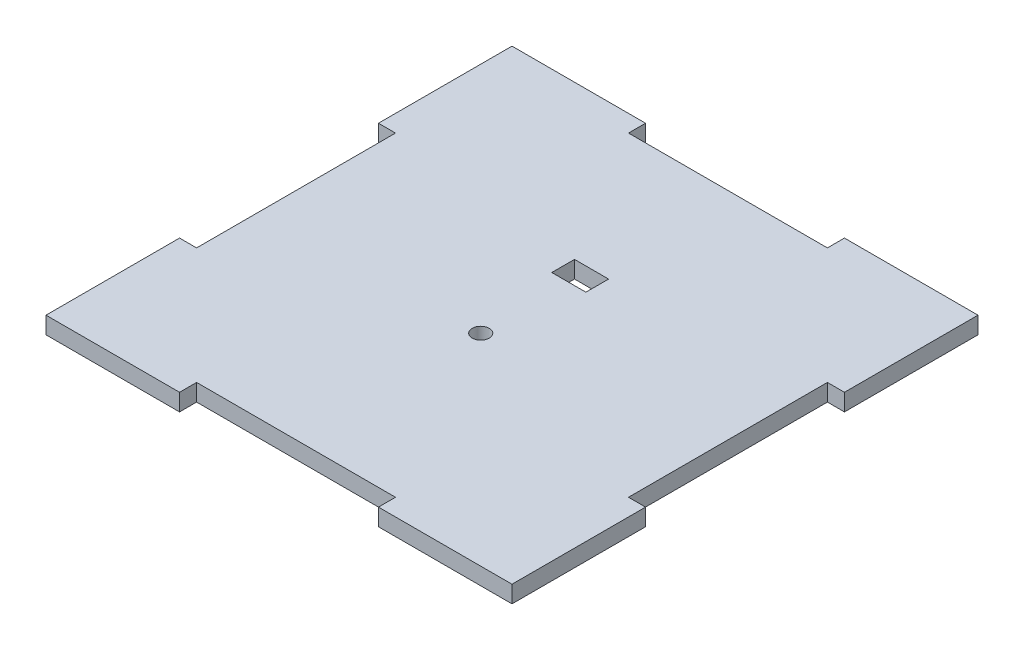
ISO-10303-21;
HEADER;
FILE_DESCRIPTION(('STEP AP214'),'2;1');
FILE_NAME('part.step','',(''),(''),'','','');
FILE_SCHEMA(('AUTOMOTIVE_DESIGN { 1 0 10303 214 1 1 1 1 }'));
ENDSEC;
DATA;
#1=APPLICATION_CONTEXT('core data for automotive mechanical design processes');
#2=APPLICATION_PROTOCOL_DEFINITION('international standard','automotive_design',2000,#1);
#3=PRODUCT_CONTEXT('',#1,'mechanical');
#4=PRODUCT('Part','Part','',(#3));
#5=PRODUCT_RELATED_PRODUCT_CATEGORY('part','',(#4));
#6=PRODUCT_DEFINITION_FORMATION('','',#4);
#7=PRODUCT_DEFINITION_CONTEXT('part definition',#1,'design');
#8=PRODUCT_DEFINITION('design','',#6,#7);
#9=PRODUCT_DEFINITION_SHAPE('','',#8);
#10=(LENGTH_UNIT() NAMED_UNIT(*) SI_UNIT(.MILLI.,.METRE.));
#11=(NAMED_UNIT(*) PLANE_ANGLE_UNIT() SI_UNIT($,.RADIAN.));
#12=(NAMED_UNIT(*) SI_UNIT($,.STERADIAN.) SOLID_ANGLE_UNIT());
#13=UNCERTAINTY_MEASURE_WITH_UNIT(LENGTH_MEASURE(1.E-05),#10,'distance_accuracy_value','');
#14=(GEOMETRIC_REPRESENTATION_CONTEXT(3) GLOBAL_UNCERTAINTY_ASSIGNED_CONTEXT((#13)) GLOBAL_UNIT_ASSIGNED_CONTEXT((#10,
#11,#12)) REPRESENTATION_CONTEXT('',''));
#15=CARTESIAN_POINT('',(0.,0.,0.));
#16=DIRECTION('',(0.,0.,1.));
#17=DIRECTION('',(1.,0.,0.));
#18=AXIS2_PLACEMENT_3D('',#15,#16,#17);
#19=CARTESIAN_POINT('',(41.,3.,-17.5));
#20=DIRECTION('',(-1.,0.,0.));
#21=DIRECTION('',(0.,0.,1.));
#22=AXIS2_PLACEMENT_3D('',#19,#20,#21);
#23=PLANE('',#22);
#24=DIRECTION('',(0.,0.,-1.));
#25=VECTOR('',#24,1.);
#26=CARTESIAN_POINT('',(41.,0.,-17.5));
#27=LINE('',#26,#25);
#28=CARTESIAN_POINT('',(41.,0.,-17.5));
#29=VERTEX_POINT('',#28);
#30=CARTESIAN_POINT('',(41.,0.,-41.));
#31=VERTEX_POINT('',#30);
#32=EDGE_CURVE('E243',#29,#31,#27,.T.);
#33=ORIENTED_EDGE('',*,*,#32,.T.);
#34=DIRECTION('',(0.,-1.,0.));
#35=VECTOR('',#34,1.);
#36=CARTESIAN_POINT('',(41.,3.,-41.));
#37=LINE('',#36,#35);
#38=CARTESIAN_POINT('',(41.,3.,-41.));
#39=VERTEX_POINT('',#38);
#40=EDGE_CURVE('E11',#39,#31,#37,.T.);
#41=ORIENTED_EDGE('',*,*,#40,.F.);
#42=DIRECTION('',(0.,0.,-1.));
#43=VECTOR('',#42,1.);
#44=CARTESIAN_POINT('',(41.,3.,-17.5));
#45=LINE('',#44,#43);
#46=CARTESIAN_POINT('',(41.,3.,-17.5));
#47=VERTEX_POINT('',#46);
#48=EDGE_CURVE('E256',#47,#39,#45,.T.);
#49=ORIENTED_EDGE('',*,*,#48,.F.);
#50=DIRECTION('',(0.,-1.,0.));
#51=VECTOR('',#50,1.);
#52=CARTESIAN_POINT('',(41.,3.,-17.5));
#53=LINE('',#52,#51);
#54=EDGE_CURVE('E318',#47,#29,#53,.T.);
#55=ORIENTED_EDGE('',*,*,#54,.T.);
#56=EDGE_LOOP('',(#33,#41,#49,#55));
#57=FACE_BOUND('',#56,.T.);
#58=ADVANCED_FACE('F38',(#57),#23,.F.);
#59=CARTESIAN_POINT('',(17.5,3.,-41.));
#60=DIRECTION('',(0.,0.,1.));
#61=DIRECTION('',(1.,0.,0.));
#62=AXIS2_PLACEMENT_3D('',#59,#60,#61);
#63=PLANE('',#62);
#64=DIRECTION('',(-1.,0.,0.));
#65=VECTOR('',#64,1.);
#66=CARTESIAN_POINT('',(17.5,0.,-41.));
#67=LINE('',#66,#65);
#68=CARTESIAN_POINT('',(17.5,0.,-41.));
#69=VERTEX_POINT('',#68);
#70=EDGE_CURVE('E322',#31,#69,#67,.T.);
#71=ORIENTED_EDGE('',*,*,#70,.T.);
#72=DIRECTION('',(0.,-1.,0.));
#73=VECTOR('',#72,1.);
#74=CARTESIAN_POINT('',(17.5,3.,-41.));
#75=LINE('',#74,#73);
#76=CARTESIAN_POINT('',(17.5,3.,-41.));
#77=VERTEX_POINT('',#76);
#78=EDGE_CURVE('E46',#77,#69,#75,.T.);
#79=ORIENTED_EDGE('',*,*,#78,.F.);
#80=DIRECTION('',(-1.,0.,0.));
#81=VECTOR('',#80,1.);
#82=CARTESIAN_POINT('',(17.5,3.,-41.));
#83=LINE('',#82,#81);
#84=EDGE_CURVE('E260',#39,#77,#83,.T.);
#85=ORIENTED_EDGE('',*,*,#84,.F.);
#86=ORIENTED_EDGE('',*,*,#40,.T.);
#87=EDGE_LOOP('',(#71,#79,#85,#86));
#88=FACE_BOUND('',#87,.T.);
#89=ADVANCED_FACE('F476',(#88),#63,.F.);
#90=CARTESIAN_POINT('',(17.5,3.,-38.));
#91=DIRECTION('',(1.,0.,0.));
#92=DIRECTION('',(0.,0.,-1.));
#93=AXIS2_PLACEMENT_3D('',#90,#91,#92);
#94=PLANE('',#93);
#95=DIRECTION('',(0.,0.,1.));
#96=VECTOR('',#95,1.);
#97=CARTESIAN_POINT('',(17.5,0.,-38.));
#98=LINE('',#97,#96);
#99=CARTESIAN_POINT('',(17.5,0.,-38.));
#100=VERTEX_POINT('',#99);
#101=EDGE_CURVE('E325',#69,#100,#98,.T.);
#102=ORIENTED_EDGE('',*,*,#101,.T.);
#103=DIRECTION('',(0.,-1.,0.));
#104=VECTOR('',#103,1.);
#105=CARTESIAN_POINT('',(17.5,3.,-38.));
#106=LINE('',#105,#104);
#107=CARTESIAN_POINT('',(17.5,3.,-38.));
#108=VERTEX_POINT('',#107);
#109=EDGE_CURVE('E445',#108,#100,#106,.T.);
#110=ORIENTED_EDGE('',*,*,#109,.F.);
#111=DIRECTION('',(0.,0.,1.));
#112=VECTOR('',#111,1.);
#113=CARTESIAN_POINT('',(17.5,3.,-38.));
#114=LINE('',#113,#112);
#115=EDGE_CURVE('E264',#77,#108,#114,.T.);
#116=ORIENTED_EDGE('',*,*,#115,.F.);
#117=ORIENTED_EDGE('',*,*,#78,.T.);
#118=EDGE_LOOP('',(#102,#110,#116,#117));
#119=FACE_BOUND('',#118,.T.);
#120=ADVANCED_FACE('F454',(#119),#94,.F.);
#121=CARTESIAN_POINT('',(-17.5,3.,-38.));
#122=DIRECTION('',(0.,0.,1.));
#123=DIRECTION('',(1.,0.,0.));
#124=AXIS2_PLACEMENT_3D('',#121,#122,#123);
#125=PLANE('',#124);
#126=DIRECTION('',(-1.,0.,0.));
#127=VECTOR('',#126,1.);
#128=CARTESIAN_POINT('',(-17.5,0.,-38.));
#129=LINE('',#128,#127);
#130=CARTESIAN_POINT('',(-17.5,0.,-38.));
#131=VERTEX_POINT('',#130);
#132=EDGE_CURVE('E328',#100,#131,#129,.T.);
#133=ORIENTED_EDGE('',*,*,#132,.T.);
#134=DIRECTION('',(0.,-1.,0.));
#135=VECTOR('',#134,1.);
#136=CARTESIAN_POINT('',(-17.5,3.,-38.));
#137=LINE('',#136,#135);
#138=CARTESIAN_POINT('',(-17.5,3.,-38.));
#139=VERTEX_POINT('',#138);
#140=EDGE_CURVE('E441',#139,#131,#137,.T.);
#141=ORIENTED_EDGE('',*,*,#140,.F.);
#142=DIRECTION('',(-1.,0.,0.));
#143=VECTOR('',#142,1.);
#144=CARTESIAN_POINT('',(-17.5,3.,-38.));
#145=LINE('',#144,#143);
#146=EDGE_CURVE('E267',#108,#139,#145,.T.);
#147=ORIENTED_EDGE('',*,*,#146,.F.);
#148=ORIENTED_EDGE('',*,*,#109,.T.);
#149=EDGE_LOOP('',(#133,#141,#147,#148));
#150=FACE_BOUND('',#149,.T.);
#151=ADVANCED_FACE('F464',(#150),#125,.F.);
#152=CARTESIAN_POINT('',(-17.5,3.,-41.));
#153=DIRECTION('',(-1.,0.,0.));
#154=DIRECTION('',(0.,0.,1.));
#155=AXIS2_PLACEMENT_3D('',#152,#153,#154);
#156=PLANE('',#155);
#157=DIRECTION('',(0.,0.,-1.));
#158=VECTOR('',#157,1.);
#159=CARTESIAN_POINT('',(-17.5,0.,-41.));
#160=LINE('',#159,#158);
#161=CARTESIAN_POINT('',(-17.5,0.,-41.));
#162=VERTEX_POINT('',#161);
#163=EDGE_CURVE('E331',#131,#162,#160,.T.);
#164=ORIENTED_EDGE('',*,*,#163,.T.);
#165=DIRECTION('',(0.,-1.,0.));
#166=VECTOR('',#165,1.);
#167=CARTESIAN_POINT('',(-17.5,3.,-41.));
#168=LINE('',#167,#166);
#169=CARTESIAN_POINT('',(-17.5,3.,-41.));
#170=VERTEX_POINT('',#169);
#171=EDGE_CURVE('E437',#170,#162,#168,.T.);
#172=ORIENTED_EDGE('',*,*,#171,.F.);
#173=DIRECTION('',(0.,0.,-1.));
#174=VECTOR('',#173,1.);
#175=CARTESIAN_POINT('',(-17.5,3.,-41.));
#176=LINE('',#175,#174);
#177=EDGE_CURVE('E270',#139,#170,#176,.T.);
#178=ORIENTED_EDGE('',*,*,#177,.F.);
#179=ORIENTED_EDGE('',*,*,#140,.T.);
#180=EDGE_LOOP('',(#164,#172,#178,#179));
#181=FACE_BOUND('',#180,.T.);
#182=ADVANCED_FACE('F468',(#181),#156,.F.);
#183=CARTESIAN_POINT('',(-41.,3.,-41.));
#184=DIRECTION('',(0.,0.,1.));
#185=DIRECTION('',(1.,0.,0.));
#186=AXIS2_PLACEMENT_3D('',#183,#184,#185);
#187=PLANE('',#186);
#188=DIRECTION('',(-1.,0.,0.));
#189=VECTOR('',#188,1.);
#190=CARTESIAN_POINT('',(-41.,0.,-41.));
#191=LINE('',#190,#189);
#192=CARTESIAN_POINT('',(-41.,0.,-41.));
#193=VERTEX_POINT('',#192);
#194=EDGE_CURVE('E334',#162,#193,#191,.T.);
#195=ORIENTED_EDGE('',*,*,#194,.T.);
#196=DIRECTION('',(0.,-1.,0.));
#197=VECTOR('',#196,1.);
#198=CARTESIAN_POINT('',(-41.,3.,-41.));
#199=LINE('',#198,#197);
#200=CARTESIAN_POINT('',(-41.,3.,-41.));
#201=VERTEX_POINT('',#200);
#202=EDGE_CURVE('E433',#201,#193,#199,.T.);
#203=ORIENTED_EDGE('',*,*,#202,.F.);
#204=DIRECTION('',(-1.,0.,0.));
#205=VECTOR('',#204,1.);
#206=CARTESIAN_POINT('',(-41.,3.,-41.));
#207=LINE('',#206,#205);
#208=EDGE_CURVE('E273',#170,#201,#207,.T.);
#209=ORIENTED_EDGE('',*,*,#208,.F.);
#210=ORIENTED_EDGE('',*,*,#171,.T.);
#211=EDGE_LOOP('',(#195,#203,#209,#210));
#212=FACE_BOUND('',#211,.T.);
#213=ADVANCED_FACE('F549',(#212),#187,.F.);
#214=CARTESIAN_POINT('',(-41.,3.,-17.5));
#215=DIRECTION('',(1.,0.,0.));
#216=DIRECTION('',(0.,0.,-1.));
#217=AXIS2_PLACEMENT_3D('',#214,#215,#216);
#218=PLANE('',#217);
#219=DIRECTION('',(0.,0.,1.));
#220=VECTOR('',#219,1.);
#221=CARTESIAN_POINT('',(-41.,0.,-17.5));
#222=LINE('',#221,#220);
#223=CARTESIAN_POINT('',(-41.,0.,-17.5));
#224=VERTEX_POINT('',#223);
#225=EDGE_CURVE('E337',#193,#224,#222,.T.);
#226=ORIENTED_EDGE('',*,*,#225,.T.);
#227=DIRECTION('',(0.,-1.,0.));
#228=VECTOR('',#227,1.);
#229=CARTESIAN_POINT('',(-41.,3.,-17.5));
#230=LINE('',#229,#228);
#231=CARTESIAN_POINT('',(-41.,3.,-17.5));
#232=VERTEX_POINT('',#231);
#233=EDGE_CURVE('E429',#232,#224,#230,.T.);
#234=ORIENTED_EDGE('',*,*,#233,.F.);
#235=DIRECTION('',(0.,0.,1.));
#236=VECTOR('',#235,1.);
#237=CARTESIAN_POINT('',(-41.,3.,-17.5));
#238=LINE('',#237,#236);
#239=EDGE_CURVE('E276',#201,#232,#238,.T.);
#240=ORIENTED_EDGE('',*,*,#239,.F.);
#241=ORIENTED_EDGE('',*,*,#202,.T.);
#242=EDGE_LOOP('',(#226,#234,#240,#241));
#243=FACE_BOUND('',#242,.T.);
#244=ADVANCED_FACE('F547',(#243),#218,.F.);
#245=CARTESIAN_POINT('',(-41.,3.,-17.5));
#246=DIRECTION('',(0.,0.,-1.));
#247=DIRECTION('',(-1.,0.,0.));
#248=AXIS2_PLACEMENT_3D('',#245,#246,#247);
#249=PLANE('',#248);
#250=DIRECTION('',(1.,0.,0.));
#251=VECTOR('',#250,1.);
#252=CARTESIAN_POINT('',(-41.,0.,-17.5));
#253=LINE('',#252,#251);
#254=CARTESIAN_POINT('',(-38.,0.,-17.5));
#255=VERTEX_POINT('',#254);
#256=EDGE_CURVE('E340',#224,#255,#253,.T.);
#257=ORIENTED_EDGE('',*,*,#256,.T.);
#258=DIRECTION('',(0.,-1.,0.));
#259=VECTOR('',#258,1.);
#260=CARTESIAN_POINT('',(-38.,3.,-17.5));
#261=LINE('',#260,#259);
#262=CARTESIAN_POINT('',(-38.,3.,-17.5));
#263=VERTEX_POINT('',#262);
#264=EDGE_CURVE('E425',#263,#255,#261,.T.);
#265=ORIENTED_EDGE('',*,*,#264,.F.);
#266=DIRECTION('',(1.,0.,0.));
#267=VECTOR('',#266,1.);
#268=CARTESIAN_POINT('',(-41.,3.,-17.5));
#269=LINE('',#268,#267);
#270=EDGE_CURVE('E279',#232,#263,#269,.T.);
#271=ORIENTED_EDGE('',*,*,#270,.F.);
#272=ORIENTED_EDGE('',*,*,#233,.T.);
#273=EDGE_LOOP('',(#257,#265,#271,#272));
#274=FACE_BOUND('',#273,.T.);
#275=ADVANCED_FACE('F542',(#274),#249,.F.);
#276=CARTESIAN_POINT('',(-38.,3.,-17.5));
#277=DIRECTION('',(1.,0.,0.));
#278=DIRECTION('',(0.,0.,-1.));
#279=AXIS2_PLACEMENT_3D('',#276,#277,#278);
#280=PLANE('',#279);
#281=DIRECTION('',(0.,0.,1.));
#282=VECTOR('',#281,1.);
#283=CARTESIAN_POINT('',(-38.,0.,-17.5));
#284=LINE('',#283,#282);
#285=CARTESIAN_POINT('',(-38.,0.,17.5));
#286=VERTEX_POINT('',#285);
#287=EDGE_CURVE('E343',#255,#286,#284,.T.);
#288=ORIENTED_EDGE('',*,*,#287,.T.);
#289=DIRECTION('',(0.,-1.,0.));
#290=VECTOR('',#289,1.);
#291=CARTESIAN_POINT('',(-38.,3.,17.5));
#292=LINE('',#291,#290);
#293=CARTESIAN_POINT('',(-38.,3.,17.5));
#294=VERTEX_POINT('',#293);
#295=EDGE_CURVE('E421',#294,#286,#292,.T.);
#296=ORIENTED_EDGE('',*,*,#295,.F.);
#297=DIRECTION('',(0.,0.,1.));
#298=VECTOR('',#297,1.);
#299=CARTESIAN_POINT('',(-38.,3.,-17.5));
#300=LINE('',#299,#298);
#301=EDGE_CURVE('E282',#263,#294,#300,.T.);
#302=ORIENTED_EDGE('',*,*,#301,.F.);
#303=ORIENTED_EDGE('',*,*,#264,.T.);
#304=EDGE_LOOP('',(#288,#296,#302,#303));
#305=FACE_BOUND('',#304,.T.);
#306=ADVANCED_FACE('F537',(#305),#280,.F.);
#307=CARTESIAN_POINT('',(-38.,3.,17.5));
#308=DIRECTION('',(0.,0.,1.));
#309=DIRECTION('',(1.,0.,0.));
#310=AXIS2_PLACEMENT_3D('',#307,#308,#309);
#311=PLANE('',#310);
#312=DIRECTION('',(-1.,0.,0.));
#313=VECTOR('',#312,1.);
#314=CARTESIAN_POINT('',(-38.,0.,17.5));
#315=LINE('',#314,#313);
#316=CARTESIAN_POINT('',(-41.,0.,17.5));
#317=VERTEX_POINT('',#316);
#318=EDGE_CURVE('E346',#286,#317,#315,.T.);
#319=ORIENTED_EDGE('',*,*,#318,.T.);
#320=DIRECTION('',(0.,-1.,0.));
#321=VECTOR('',#320,1.);
#322=CARTESIAN_POINT('',(-41.,3.,17.5));
#323=LINE('',#322,#321);
#324=CARTESIAN_POINT('',(-41.,3.,17.5));
#325=VERTEX_POINT('',#324);
#326=EDGE_CURVE('E417',#325,#317,#323,.T.);
#327=ORIENTED_EDGE('',*,*,#326,.F.);
#328=DIRECTION('',(-1.,0.,0.));
#329=VECTOR('',#328,1.);
#330=CARTESIAN_POINT('',(-38.,3.,17.5));
#331=LINE('',#330,#329);
#332=EDGE_CURVE('E285',#294,#325,#331,.T.);
#333=ORIENTED_EDGE('',*,*,#332,.F.);
#334=ORIENTED_EDGE('',*,*,#295,.T.);
#335=EDGE_LOOP('',(#319,#327,#333,#334));
#336=FACE_BOUND('',#335,.T.);
#337=ADVANCED_FACE('F533',(#336),#311,.F.);
#338=CARTESIAN_POINT('',(-41.,3.,41.));
#339=DIRECTION('',(1.,0.,0.));
#340=DIRECTION('',(0.,0.,-1.));
#341=AXIS2_PLACEMENT_3D('',#338,#339,#340);
#342=PLANE('',#341);
#343=DIRECTION('',(0.,0.,1.));
#344=VECTOR('',#343,1.);
#345=CARTESIAN_POINT('',(-41.,0.,41.));
#346=LINE('',#345,#344);
#347=CARTESIAN_POINT('',(-41.,0.,41.));
#348=VERTEX_POINT('',#347);
#349=EDGE_CURVE('E349',#317,#348,#346,.T.);
#350=ORIENTED_EDGE('',*,*,#349,.T.);
#351=DIRECTION('',(0.,-1.,0.));
#352=VECTOR('',#351,1.);
#353=CARTESIAN_POINT('',(-41.,3.,41.));
#354=LINE('',#353,#352);
#355=CARTESIAN_POINT('',(-41.,3.,41.));
#356=VERTEX_POINT('',#355);
#357=EDGE_CURVE('E413',#356,#348,#354,.T.);
#358=ORIENTED_EDGE('',*,*,#357,.F.);
#359=DIRECTION('',(0.,0.,1.));
#360=VECTOR('',#359,1.);
#361=CARTESIAN_POINT('',(-41.,3.,41.));
#362=LINE('',#361,#360);
#363=EDGE_CURVE('E288',#325,#356,#362,.T.);
#364=ORIENTED_EDGE('',*,*,#363,.F.);
#365=ORIENTED_EDGE('',*,*,#326,.T.);
#366=EDGE_LOOP('',(#350,#358,#364,#365));
#367=FACE_BOUND('',#366,.T.);
#368=ADVANCED_FACE('F528',(#367),#342,.F.);
#369=CARTESIAN_POINT('',(-41.,3.,41.));
#370=DIRECTION('',(0.,0.,-1.));
#371=DIRECTION('',(-1.,0.,0.));
#372=AXIS2_PLACEMENT_3D('',#369,#370,#371);
#373=PLANE('',#372);
#374=DIRECTION('',(1.,0.,0.));
#375=VECTOR('',#374,1.);
#376=CARTESIAN_POINT('',(-41.,0.,41.));
#377=LINE('',#376,#375);
#378=CARTESIAN_POINT('',(-17.5,0.,41.));
#379=VERTEX_POINT('',#378);
#380=EDGE_CURVE('E352',#348,#379,#377,.T.);
#381=ORIENTED_EDGE('',*,*,#380,.T.);
#382=DIRECTION('',(0.,-1.,0.));
#383=VECTOR('',#382,1.);
#384=CARTESIAN_POINT('',(-17.5,3.,41.));
#385=LINE('',#384,#383);
#386=CARTESIAN_POINT('',(-17.5,3.,41.));
#387=VERTEX_POINT('',#386);
#388=EDGE_CURVE('E409',#387,#379,#385,.T.);
#389=ORIENTED_EDGE('',*,*,#388,.F.);
#390=DIRECTION('',(1.,0.,0.));
#391=VECTOR('',#390,1.);
#392=CARTESIAN_POINT('',(-41.,3.,41.));
#393=LINE('',#392,#391);
#394=EDGE_CURVE('E291',#356,#387,#393,.T.);
#395=ORIENTED_EDGE('',*,*,#394,.F.);
#396=ORIENTED_EDGE('',*,*,#357,.T.);
#397=EDGE_LOOP('',(#381,#389,#395,#396));
#398=FACE_BOUND('',#397,.T.);
#399=ADVANCED_FACE('F522',(#398),#373,.F.);
#400=CARTESIAN_POINT('',(-17.5,3.,38.));
#401=DIRECTION('',(-1.,0.,0.));
#402=DIRECTION('',(0.,0.,1.));
#403=AXIS2_PLACEMENT_3D('',#400,#401,#402);
#404=PLANE('',#403);
#405=DIRECTION('',(0.,0.,-1.));
#406=VECTOR('',#405,1.);
#407=CARTESIAN_POINT('',(-17.5,0.,38.));
#408=LINE('',#407,#406);
#409=CARTESIAN_POINT('',(-17.5,0.,38.));
#410=VERTEX_POINT('',#409);
#411=EDGE_CURVE('E355',#379,#410,#408,.T.);
#412=ORIENTED_EDGE('',*,*,#411,.T.);
#413=DIRECTION('',(0.,-1.,0.));
#414=VECTOR('',#413,1.);
#415=CARTESIAN_POINT('',(-17.5,3.,38.));
#416=LINE('',#415,#414);
#417=CARTESIAN_POINT('',(-17.5,3.,38.));
#418=VERTEX_POINT('',#417);
#419=EDGE_CURVE('E405',#418,#410,#416,.T.);
#420=ORIENTED_EDGE('',*,*,#419,.F.);
#421=DIRECTION('',(0.,0.,-1.));
#422=VECTOR('',#421,1.);
#423=CARTESIAN_POINT('',(-17.5,3.,38.));
#424=LINE('',#423,#422);
#425=EDGE_CURVE('E294',#387,#418,#424,.T.);
#426=ORIENTED_EDGE('',*,*,#425,.F.);
#427=ORIENTED_EDGE('',*,*,#388,.T.);
#428=EDGE_LOOP('',(#412,#420,#426,#427));
#429=FACE_BOUND('',#428,.T.);
#430=ADVANCED_FACE('F518',(#429),#404,.F.);
#431=CARTESIAN_POINT('',(17.5,3.,38.));
#432=DIRECTION('',(0.,0.,-1.));
#433=DIRECTION('',(-1.,0.,0.));
#434=AXIS2_PLACEMENT_3D('',#431,#432,#433);
#435=PLANE('',#434);
#436=DIRECTION('',(1.,0.,0.));
#437=VECTOR('',#436,1.);
#438=CARTESIAN_POINT('',(17.5,0.,38.));
#439=LINE('',#438,#437);
#440=CARTESIAN_POINT('',(17.5,0.,38.));
#441=VERTEX_POINT('',#440);
#442=EDGE_CURVE('E358',#410,#441,#439,.T.);
#443=ORIENTED_EDGE('',*,*,#442,.T.);
#444=DIRECTION('',(0.,-1.,0.));
#445=VECTOR('',#444,1.);
#446=CARTESIAN_POINT('',(17.5,3.,38.));
#447=LINE('',#446,#445);
#448=CARTESIAN_POINT('',(17.5,3.,38.));
#449=VERTEX_POINT('',#448);
#450=EDGE_CURVE('E401',#449,#441,#447,.T.);
#451=ORIENTED_EDGE('',*,*,#450,.F.);
#452=DIRECTION('',(1.,0.,0.));
#453=VECTOR('',#452,1.);
#454=CARTESIAN_POINT('',(17.5,3.,38.));
#455=LINE('',#454,#453);
#456=EDGE_CURVE('E297',#418,#449,#455,.T.);
#457=ORIENTED_EDGE('',*,*,#456,.F.);
#458=ORIENTED_EDGE('',*,*,#419,.T.);
#459=EDGE_LOOP('',(#443,#451,#457,#458));
#460=FACE_BOUND('',#459,.T.);
#461=ADVANCED_FACE('F513',(#460),#435,.F.);
#462=CARTESIAN_POINT('',(17.5,3.,41.));
#463=DIRECTION('',(1.,0.,0.));
#464=DIRECTION('',(0.,0.,-1.));
#465=AXIS2_PLACEMENT_3D('',#462,#463,#464);
#466=PLANE('',#465);
#467=DIRECTION('',(0.,0.,1.));
#468=VECTOR('',#467,1.);
#469=CARTESIAN_POINT('',(17.5,0.,41.));
#470=LINE('',#469,#468);
#471=CARTESIAN_POINT('',(17.5,0.,41.));
#472=VERTEX_POINT('',#471);
#473=EDGE_CURVE('E361',#441,#472,#470,.T.);
#474=ORIENTED_EDGE('',*,*,#473,.T.);
#475=DIRECTION('',(0.,-1.,0.));
#476=VECTOR('',#475,1.);
#477=CARTESIAN_POINT('',(17.5,3.,41.));
#478=LINE('',#477,#476);
#479=CARTESIAN_POINT('',(17.5,3.,41.));
#480=VERTEX_POINT('',#479);
#481=EDGE_CURVE('E397',#480,#472,#478,.T.);
#482=ORIENTED_EDGE('',*,*,#481,.F.);
#483=DIRECTION('',(0.,0.,1.));
#484=VECTOR('',#483,1.);
#485=CARTESIAN_POINT('',(17.5,3.,41.));
#486=LINE('',#485,#484);
#487=EDGE_CURVE('E300',#449,#480,#486,.T.);
#488=ORIENTED_EDGE('',*,*,#487,.F.);
#489=ORIENTED_EDGE('',*,*,#450,.T.);
#490=EDGE_LOOP('',(#474,#482,#488,#489));
#491=FACE_BOUND('',#490,.T.);
#492=ADVANCED_FACE('F507',(#491),#466,.F.);
#493=CARTESIAN_POINT('',(17.5,3.,41.));
#494=DIRECTION('',(0.,0.,-1.));
#495=DIRECTION('',(-1.,0.,0.));
#496=AXIS2_PLACEMENT_3D('',#493,#494,#495);
#497=PLANE('',#496);
#498=DIRECTION('',(1.,0.,0.));
#499=VECTOR('',#498,1.);
#500=CARTESIAN_POINT('',(17.5,0.,41.));
#501=LINE('',#500,#499);
#502=CARTESIAN_POINT('',(41.,0.,41.));
#503=VERTEX_POINT('',#502);
#504=EDGE_CURVE('E364',#472,#503,#501,.T.);
#505=ORIENTED_EDGE('',*,*,#504,.T.);
#506=DIRECTION('',(0.,-1.,0.));
#507=VECTOR('',#506,1.);
#508=CARTESIAN_POINT('',(41.,3.,41.));
#509=LINE('',#508,#507);
#510=CARTESIAN_POINT('',(41.,3.,41.));
#511=VERTEX_POINT('',#510);
#512=EDGE_CURVE('E393',#511,#503,#509,.T.);
#513=ORIENTED_EDGE('',*,*,#512,.F.);
#514=DIRECTION('',(1.,0.,0.));
#515=VECTOR('',#514,1.);
#516=CARTESIAN_POINT('',(17.5,3.,41.));
#517=LINE('',#516,#515);
#518=EDGE_CURVE('E303',#480,#511,#517,.T.);
#519=ORIENTED_EDGE('',*,*,#518,.F.);
#520=ORIENTED_EDGE('',*,*,#481,.T.);
#521=EDGE_LOOP('',(#505,#513,#519,#520));
#522=FACE_BOUND('',#521,.T.);
#523=ADVANCED_FACE('F503',(#522),#497,.F.);
#524=CARTESIAN_POINT('',(41.,3.,41.));
#525=DIRECTION('',(-1.,0.,0.));
#526=DIRECTION('',(0.,0.,1.));
#527=AXIS2_PLACEMENT_3D('',#524,#525,#526);
#528=PLANE('',#527);
#529=DIRECTION('',(0.,0.,-1.));
#530=VECTOR('',#529,1.);
#531=CARTESIAN_POINT('',(41.,0.,41.));
#532=LINE('',#531,#530);
#533=CARTESIAN_POINT('',(41.,0.,17.5));
#534=VERTEX_POINT('',#533);
#535=EDGE_CURVE('E367',#503,#534,#532,.T.);
#536=ORIENTED_EDGE('',*,*,#535,.T.);
#537=DIRECTION('',(0.,-1.,0.));
#538=VECTOR('',#537,1.);
#539=CARTESIAN_POINT('',(41.,3.,17.5));
#540=LINE('',#539,#538);
#541=CARTESIAN_POINT('',(41.,3.,17.5));
#542=VERTEX_POINT('',#541);
#543=EDGE_CURVE('E389',#542,#534,#540,.T.);
#544=ORIENTED_EDGE('',*,*,#543,.F.);
#545=DIRECTION('',(0.,0.,-1.));
#546=VECTOR('',#545,1.);
#547=CARTESIAN_POINT('',(41.,3.,41.));
#548=LINE('',#547,#546);
#549=EDGE_CURVE('E306',#511,#542,#548,.T.);
#550=ORIENTED_EDGE('',*,*,#549,.F.);
#551=ORIENTED_EDGE('',*,*,#512,.T.);
#552=EDGE_LOOP('',(#536,#544,#550,#551));
#553=FACE_BOUND('',#552,.T.);
#554=ADVANCED_FACE('F498',(#553),#528,.F.);
#555=CARTESIAN_POINT('',(38.,3.,17.5));
#556=DIRECTION('',(0.,0.,1.));
#557=DIRECTION('',(1.,0.,0.));
#558=AXIS2_PLACEMENT_3D('',#555,#556,#557);
#559=PLANE('',#558);
#560=DIRECTION('',(-1.,0.,0.));
#561=VECTOR('',#560,1.);
#562=CARTESIAN_POINT('',(38.,0.,17.5));
#563=LINE('',#562,#561);
#564=CARTESIAN_POINT('',(38.,0.,17.5));
#565=VERTEX_POINT('',#564);
#566=EDGE_CURVE('E370',#534,#565,#563,.T.);
#567=ORIENTED_EDGE('',*,*,#566,.T.);
#568=DIRECTION('',(0.,-1.,0.));
#569=VECTOR('',#568,1.);
#570=CARTESIAN_POINT('',(38.,3.,17.5));
#571=LINE('',#570,#569);
#572=CARTESIAN_POINT('',(38.,3.,17.5));
#573=VERTEX_POINT('',#572);
#574=EDGE_CURVE('E385',#573,#565,#571,.T.);
#575=ORIENTED_EDGE('',*,*,#574,.F.);
#576=DIRECTION('',(-1.,0.,0.));
#577=VECTOR('',#576,1.);
#578=CARTESIAN_POINT('',(38.,3.,17.5));
#579=LINE('',#578,#577);
#580=EDGE_CURVE('E309',#542,#573,#579,.T.);
#581=ORIENTED_EDGE('',*,*,#580,.F.);
#582=ORIENTED_EDGE('',*,*,#543,.T.);
#583=EDGE_LOOP('',(#567,#575,#581,#582));
#584=FACE_BOUND('',#583,.T.);
#585=ADVANCED_FACE('F492',(#584),#559,.F.);
#586=CARTESIAN_POINT('',(38.,3.,-17.5));
#587=DIRECTION('',(-1.,0.,0.));
#588=DIRECTION('',(0.,0.,1.));
#589=AXIS2_PLACEMENT_3D('',#586,#587,#588);
#590=PLANE('',#589);
#591=DIRECTION('',(0.,0.,-1.));
#592=VECTOR('',#591,1.);
#593=CARTESIAN_POINT('',(38.,0.,-17.5));
#594=LINE('',#593,#592);
#595=CARTESIAN_POINT('',(38.,0.,-17.5));
#596=VERTEX_POINT('',#595);
#597=EDGE_CURVE('E373',#565,#596,#594,.T.);
#598=ORIENTED_EDGE('',*,*,#597,.T.);
#599=DIRECTION('',(0.,-1.,0.));
#600=VECTOR('',#599,1.);
#601=CARTESIAN_POINT('',(38.,3.,-17.5));
#602=LINE('',#601,#600);
#603=CARTESIAN_POINT('',(38.,3.,-17.5));
#604=VERTEX_POINT('',#603);
#605=EDGE_CURVE('E381',#604,#596,#602,.T.);
#606=ORIENTED_EDGE('',*,*,#605,.F.);
#607=DIRECTION('',(0.,0.,-1.));
#608=VECTOR('',#607,1.);
#609=CARTESIAN_POINT('',(38.,3.,-17.5));
#610=LINE('',#609,#608);
#611=EDGE_CURVE('E312',#573,#604,#610,.T.);
#612=ORIENTED_EDGE('',*,*,#611,.F.);
#613=ORIENTED_EDGE('',*,*,#574,.T.);
#614=EDGE_LOOP('',(#598,#606,#612,#613));
#615=FACE_BOUND('',#614,.T.);
#616=ADVANCED_FACE('F488',(#615),#590,.F.);
#617=CARTESIAN_POINT('',(41.,3.,-17.5));
#618=DIRECTION('',(0.,0.,-1.));
#619=DIRECTION('',(-1.,0.,0.));
#620=AXIS2_PLACEMENT_3D('',#617,#618,#619);
#621=PLANE('',#620);
#622=DIRECTION('',(1.,0.,0.));
#623=VECTOR('',#622,1.);
#624=CARTESIAN_POINT('',(41.,0.,-17.5));
#625=LINE('',#624,#623);
#626=EDGE_CURVE('E261',#596,#29,#625,.T.);
#627=ORIENTED_EDGE('',*,*,#626,.T.);
#628=ORIENTED_EDGE('',*,*,#54,.F.);
#629=DIRECTION('',(1.,0.,0.));
#630=VECTOR('',#629,1.);
#631=CARTESIAN_POINT('',(41.,3.,-17.5));
#632=LINE('',#631,#630);
#633=EDGE_CURVE('E315',#604,#47,#632,.T.);
#634=ORIENTED_EDGE('',*,*,#633,.F.);
#635=ORIENTED_EDGE('',*,*,#605,.T.);
#636=EDGE_LOOP('',(#627,#628,#634,#635));
#637=FACE_BOUND('',#636,.T.);
#638=ADVANCED_FACE('F483',(#637),#621,.F.);
#639=CARTESIAN_POINT('',(0.,3.,0.));
#640=DIRECTION('',(0.,-1.,0.));
#641=DIRECTION('',(0.,0.,-1.));
#642=AXIS2_PLACEMENT_3D('',#639,#640,#641);
#643=PLANE('',#642);
#644=DIRECTION('',(-1.,0.,0.));
#645=VECTOR('',#644,1.);
#646=CARTESIAN_POINT('',(-3.,3.,-14.));
#647=LINE('',#646,#645);
#648=CARTESIAN_POINT('',(3.,3.,-14.));
#649=VERTEX_POINT('',#648);
#650=CARTESIAN_POINT('',(-3.,3.,-14.));
#651=VERTEX_POINT('',#650);
#652=EDGE_CURVE('E233',#649,#651,#647,.T.);
#653=ORIENTED_EDGE('',*,*,#652,.F.);
#654=DIRECTION('',(0.,0.,-1.));
#655=VECTOR('',#654,1.);
#656=CARTESIAN_POINT('',(3.,3.,-14.));
#657=LINE('',#656,#655);
#658=CARTESIAN_POINT('',(3.,3.,-10.));
#659=VERTEX_POINT('',#658);
#660=EDGE_CURVE('E53',#659,#649,#657,.T.);
#661=ORIENTED_EDGE('',*,*,#660,.F.);
#662=DIRECTION('',(1.,0.,0.));
#663=VECTOR('',#662,1.);
#664=CARTESIAN_POINT('',(-3.,3.,-10.));
#665=LINE('',#664,#663);
#666=CARTESIAN_POINT('',(-3.,3.,-10.));
#667=VERTEX_POINT('',#666);
#668=EDGE_CURVE('E220',#667,#659,#665,.T.);
#669=ORIENTED_EDGE('',*,*,#668,.F.);
#670=DIRECTION('',(0.,0.,1.));
#671=VECTOR('',#670,1.);
#672=CARTESIAN_POINT('',(-3.,3.,-14.));
#673=LINE('',#672,#671);
#674=EDGE_CURVE('E224',#651,#667,#673,.T.);
#675=ORIENTED_EDGE('',*,*,#674,.F.);
#676=EDGE_LOOP('',(#653,#661,#669,#675));
#677=FACE_BOUND('',#676,.T.);
#678=CARTESIAN_POINT('',(0.,3.,5.5));
#679=DIRECTION('',(0.,1.,0.));
#680=DIRECTION('',(0.,0.,1.));
#681=AXIS2_PLACEMENT_3D('',#678,#679,#680);
#682=CIRCLE('',#681,1.5);
#683=CARTESIAN_POINT('',(0.,3.,7.));
#684=VERTEX_POINT('',#683);
#685=EDGE_CURVE('E252',#684,#684,#682,.T.);
#686=ORIENTED_EDGE('',*,*,#685,.F.);
#687=EDGE_LOOP('',(#686));
#688=FACE_BOUND('',#687,.T.);
#689=ORIENTED_EDGE('',*,*,#48,.T.);
#690=ORIENTED_EDGE('',*,*,#84,.T.);
#691=ORIENTED_EDGE('',*,*,#115,.T.);
#692=ORIENTED_EDGE('',*,*,#146,.T.);
#693=ORIENTED_EDGE('',*,*,#177,.T.);
#694=ORIENTED_EDGE('',*,*,#208,.T.);
#695=ORIENTED_EDGE('',*,*,#239,.T.);
#696=ORIENTED_EDGE('',*,*,#270,.T.);
#697=ORIENTED_EDGE('',*,*,#301,.T.);
#698=ORIENTED_EDGE('',*,*,#332,.T.);
#699=ORIENTED_EDGE('',*,*,#363,.T.);
#700=ORIENTED_EDGE('',*,*,#394,.T.);
#701=ORIENTED_EDGE('',*,*,#425,.T.);
#702=ORIENTED_EDGE('',*,*,#456,.T.);
#703=ORIENTED_EDGE('',*,*,#487,.T.);
#704=ORIENTED_EDGE('',*,*,#518,.T.);
#705=ORIENTED_EDGE('',*,*,#549,.T.);
#706=ORIENTED_EDGE('',*,*,#580,.T.);
#707=ORIENTED_EDGE('',*,*,#611,.T.);
#708=ORIENTED_EDGE('',*,*,#633,.T.);
#709=EDGE_LOOP('',(#689,#690,#691,#692,#693,#694,#695,#696,#697,#698,#699,#700,#701,#702,#703,
#704,#705,#706,#707,#708));
#710=FACE_BOUND('',#709,.T.);
#711=ADVANCED_FACE('F472',(#677,#688,#710),#643,.F.);
#712=CARTESIAN_POINT('',(0.,0.,0.));
#713=DIRECTION('',(0.,-1.,0.));
#714=DIRECTION('',(0.,0.,-1.));
#715=AXIS2_PLACEMENT_3D('',#712,#713,#714);
#716=PLANE('',#715);
#717=DIRECTION('',(0.,0.,-1.));
#718=VECTOR('',#717,1.);
#719=CARTESIAN_POINT('',(3.,0.,-14.));
#720=LINE('',#719,#718);
#721=CARTESIAN_POINT('',(3.,0.,-10.));
#722=VERTEX_POINT('',#721);
#723=CARTESIAN_POINT('',(3.,0.,-14.));
#724=VERTEX_POINT('',#723);
#725=EDGE_CURVE('E201',#722,#724,#720,.T.);
#726=ORIENTED_EDGE('',*,*,#725,.T.);
#727=DIRECTION('',(-1.,0.,0.));
#728=VECTOR('',#727,1.);
#729=CARTESIAN_POINT('',(-3.,0.,-14.));
#730=LINE('',#729,#728);
#731=CARTESIAN_POINT('',(-3.,0.,-14.));
#732=VERTEX_POINT('',#731);
#733=EDGE_CURVE('E211',#724,#732,#730,.T.);
#734=ORIENTED_EDGE('',*,*,#733,.T.);
#735=DIRECTION('',(0.,0.,1.));
#736=VECTOR('',#735,1.);
#737=CARTESIAN_POINT('',(-3.,0.,-14.));
#738=LINE('',#737,#736);
#739=CARTESIAN_POINT('',(-3.,0.,-10.));
#740=VERTEX_POINT('',#739);
#741=EDGE_CURVE('E61',#732,#740,#738,.T.);
#742=ORIENTED_EDGE('',*,*,#741,.T.);
#743=DIRECTION('',(1.,0.,0.));
#744=VECTOR('',#743,1.);
#745=CARTESIAN_POINT('',(-3.,0.,-10.));
#746=LINE('',#745,#744);
#747=EDGE_CURVE('E208',#740,#722,#746,.T.);
#748=ORIENTED_EDGE('',*,*,#747,.T.);
#749=EDGE_LOOP('',(#726,#734,#742,#748));
#750=FACE_BOUND('',#749,.T.);
#751=CARTESIAN_POINT('',(0.,0.,5.5));
#752=DIRECTION('',(0.,1.,0.));
#753=DIRECTION('',(0.,0.,1.));
#754=AXIS2_PLACEMENT_3D('',#751,#752,#753);
#755=CIRCLE('',#754,1.5);
#756=CARTESIAN_POINT('',(0.,0.,7.));
#757=VERTEX_POINT('',#756);
#758=EDGE_CURVE('E234',#757,#757,#755,.T.);
#759=ORIENTED_EDGE('',*,*,#758,.T.);
#760=EDGE_LOOP('',(#759));
#761=FACE_BOUND('',#760,.T.);
#762=ORIENTED_EDGE('',*,*,#32,.F.);
#763=ORIENTED_EDGE('',*,*,#626,.F.);
#764=ORIENTED_EDGE('',*,*,#597,.F.);
#765=ORIENTED_EDGE('',*,*,#566,.F.);
#766=ORIENTED_EDGE('',*,*,#535,.F.);
#767=ORIENTED_EDGE('',*,*,#504,.F.);
#768=ORIENTED_EDGE('',*,*,#473,.F.);
#769=ORIENTED_EDGE('',*,*,#442,.F.);
#770=ORIENTED_EDGE('',*,*,#411,.F.);
#771=ORIENTED_EDGE('',*,*,#380,.F.);
#772=ORIENTED_EDGE('',*,*,#349,.F.);
#773=ORIENTED_EDGE('',*,*,#318,.F.);
#774=ORIENTED_EDGE('',*,*,#287,.F.);
#775=ORIENTED_EDGE('',*,*,#256,.F.);
#776=ORIENTED_EDGE('',*,*,#225,.F.);
#777=ORIENTED_EDGE('',*,*,#194,.F.);
#778=ORIENTED_EDGE('',*,*,#163,.F.);
#779=ORIENTED_EDGE('',*,*,#132,.F.);
#780=ORIENTED_EDGE('',*,*,#101,.F.);
#781=ORIENTED_EDGE('',*,*,#70,.F.);
#782=EDGE_LOOP('',(#762,#763,#764,#765,#766,#767,#768,#769,#770,#771,#772,#773,#774,#775,#776,
#777,#778,#779,#780,#781));
#783=FACE_BOUND('',#782,.T.);
#784=ADVANCED_FACE('F216',(#750,#761,#783),#716,.T.);
#785=CARTESIAN_POINT('',(0.,0.,5.5));
#786=DIRECTION('',(0.,1.,0.));
#787=DIRECTION('',(0.,0.,1.));
#788=AXIS2_PLACEMENT_3D('',#785,#786,#787);
#789=CYLINDRICAL_SURFACE('',#788,1.5);
#790=ORIENTED_EDGE('',*,*,#758,.F.);
#791=EDGE_LOOP('',(#790));
#792=FACE_BOUND('',#791,.T.);
#793=ORIENTED_EDGE('',*,*,#685,.T.);
#794=EDGE_LOOP('',(#793));
#795=FACE_BOUND('',#794,.T.);
#796=ADVANCED_FACE('F708',(#792,#795),#789,.F.);
#797=CARTESIAN_POINT('',(3.,0.,-14.));
#798=DIRECTION('',(1.,0.,0.));
#799=DIRECTION('',(0.,0.,-1.));
#800=AXIS2_PLACEMENT_3D('',#797,#798,#799);
#801=PLANE('',#800);
#802=ORIENTED_EDGE('',*,*,#660,.T.);
#803=DIRECTION('',(0.,1.,0.));
#804=VECTOR('',#803,1.);
#805=CARTESIAN_POINT('',(3.,0.,-14.));
#806=LINE('',#805,#804);
#807=EDGE_CURVE('E197',#724,#649,#806,.T.);
#808=ORIENTED_EDGE('',*,*,#807,.F.);
#809=ORIENTED_EDGE('',*,*,#725,.F.);
#810=DIRECTION('',(0.,1.,0.));
#811=VECTOR('',#810,1.);
#812=CARTESIAN_POINT('',(3.,0.,-10.));
#813=LINE('',#812,#811);
#814=EDGE_CURVE('E240',#722,#659,#813,.T.);
#815=ORIENTED_EDGE('',*,*,#814,.T.);
#816=EDGE_LOOP('',(#802,#808,#809,#815));
#817=FACE_BOUND('',#816,.T.);
#818=ADVANCED_FACE('F199',(#817),#801,.F.);
#819=CARTESIAN_POINT('',(-3.,0.,-10.));
#820=DIRECTION('',(0.,0.,1.));
#821=DIRECTION('',(1.,0.,0.));
#822=AXIS2_PLACEMENT_3D('',#819,#820,#821);
#823=PLANE('',#822);
#824=ORIENTED_EDGE('',*,*,#668,.T.);
#825=ORIENTED_EDGE('',*,*,#814,.F.);
#826=ORIENTED_EDGE('',*,*,#747,.F.);
#827=DIRECTION('',(0.,1.,0.));
#828=VECTOR('',#827,1.);
#829=CARTESIAN_POINT('',(-3.,0.,-10.));
#830=LINE('',#829,#828);
#831=EDGE_CURVE('E244',#740,#667,#830,.T.);
#832=ORIENTED_EDGE('',*,*,#831,.T.);
#833=EDGE_LOOP('',(#824,#825,#826,#832));
#834=FACE_BOUND('',#833,.T.);
#835=ADVANCED_FACE('F726',(#834),#823,.F.);
#836=CARTESIAN_POINT('',(-3.,0.,-14.));
#837=DIRECTION('',(-1.,0.,0.));
#838=DIRECTION('',(0.,0.,1.));
#839=AXIS2_PLACEMENT_3D('',#836,#837,#838);
#840=PLANE('',#839);
#841=ORIENTED_EDGE('',*,*,#674,.T.);
#842=ORIENTED_EDGE('',*,*,#831,.F.);
#843=ORIENTED_EDGE('',*,*,#741,.F.);
#844=DIRECTION('',(0.,1.,0.));
#845=VECTOR('',#844,1.);
#846=CARTESIAN_POINT('',(-3.,0.,-14.));
#847=LINE('',#846,#845);
#848=EDGE_CURVE('E207',#732,#651,#847,.T.);
#849=ORIENTED_EDGE('',*,*,#848,.T.);
#850=EDGE_LOOP('',(#841,#842,#843,#849));
#851=FACE_BOUND('',#850,.T.);
#852=ADVANCED_FACE('F735',(#851),#840,.F.);
#853=CARTESIAN_POINT('',(-3.,0.,-14.));
#854=DIRECTION('',(0.,0.,-1.));
#855=DIRECTION('',(-1.,0.,0.));
#856=AXIS2_PLACEMENT_3D('',#853,#854,#855);
#857=PLANE('',#856);
#858=ORIENTED_EDGE('',*,*,#652,.T.);
#859=ORIENTED_EDGE('',*,*,#848,.F.);
#860=ORIENTED_EDGE('',*,*,#733,.F.);
#861=ORIENTED_EDGE('',*,*,#807,.T.);
#862=EDGE_LOOP('',(#858,#859,#860,#861));
#863=FACE_BOUND('',#862,.T.);
#864=ADVANCED_FACE('F212',(#863),#857,.F.);
#865=CLOSED_SHELL('',(#58,#89,#120,#151,#182,#213,#244,#275,#306,#337,#368,#399,#430,#461,#492,
#523,#554,#585,#616,#638,#711,#784,#796,#818,#835,#852,#864));
#866=MANIFOLD_SOLID_BREP('B2',#865);
#867=ADVANCED_BREP_SHAPE_REPRESENTATION('',(#18,#866),#14);
#868=SHAPE_DEFINITION_REPRESENTATION(#9,#867);
ENDSEC;
END-ISO-10303-21;
